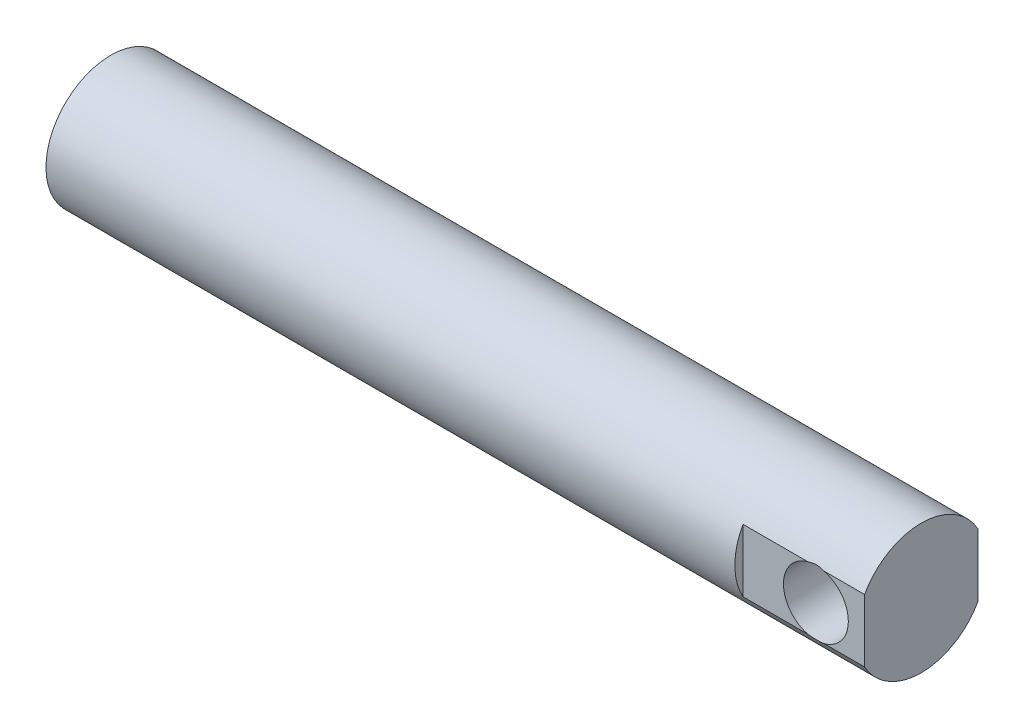
ISO-10303-21;
HEADER;
FILE_DESCRIPTION(('STEP AP214'),'2;1');
FILE_NAME('part.step','',(''),(''),'','','');
FILE_SCHEMA(('AUTOMOTIVE_DESIGN { 1 0 10303 214 1 1 1 1 }'));
ENDSEC;
DATA;
#1=APPLICATION_CONTEXT('core data for automotive mechanical design processes');
#2=APPLICATION_PROTOCOL_DEFINITION('international standard','automotive_design',2000,#1);
#3=PRODUCT_CONTEXT('',#1,'mechanical');
#4=PRODUCT('Part','Part','',(#3));
#5=PRODUCT_RELATED_PRODUCT_CATEGORY('part','',(#4));
#6=PRODUCT_DEFINITION_FORMATION('','',#4);
#7=PRODUCT_DEFINITION_CONTEXT('part definition',#1,'design');
#8=PRODUCT_DEFINITION('design','',#6,#7);
#9=PRODUCT_DEFINITION_SHAPE('','',#8);
#10=(LENGTH_UNIT() NAMED_UNIT(*) SI_UNIT(.MILLI.,.METRE.));
#11=(NAMED_UNIT(*) PLANE_ANGLE_UNIT() SI_UNIT($,.RADIAN.));
#12=(NAMED_UNIT(*) SI_UNIT($,.STERADIAN.) SOLID_ANGLE_UNIT());
#13=UNCERTAINTY_MEASURE_WITH_UNIT(LENGTH_MEASURE(1.E-05),#10,'distance_accuracy_value','');
#14=(GEOMETRIC_REPRESENTATION_CONTEXT(3) GLOBAL_UNCERTAINTY_ASSIGNED_CONTEXT((#13)) GLOBAL_UNIT_ASSIGNED_CONTEXT((#10,
#11,#12)) REPRESENTATION_CONTEXT('',''));
#15=CARTESIAN_POINT('',(0.,0.,0.));
#16=DIRECTION('',(0.,0.,1.));
#17=DIRECTION('',(1.,0.,0.));
#18=AXIS2_PLACEMENT_3D('',#15,#16,#17);
#19=CARTESIAN_POINT('',(111.125,12.2967221242086,22.225));
#20=DIRECTION('',(0.,0.,-1.));
#21=DIRECTION('',(-1.,0.,0.));
#22=AXIS2_PLACEMENT_3D('',#19,#20,#21);
#23=PLANE('',#22);
#24=DIRECTION('',(1.,0.,0.));
#25=VECTOR('',#24,1.);
#26=CARTESIAN_POINT('',(111.125,12.2967221242086,22.225));
#27=LINE('',#26,#25);
#28=CARTESIAN_POINT('',(142.875,12.2967221242086,22.225));
#29=VERTEX_POINT('',#28);
#30=CARTESIAN_POINT('',(158.75,12.2967221242086,22.225));
#31=VERTEX_POINT('',#30);
#32=EDGE_CURVE('E112',#29,#31,#27,.T.);
#33=ORIENTED_EDGE('',*,*,#32,.F.);
#34=CARTESIAN_POINT('',(139.7,0.,22.225));
#35=DIRECTION('',(0.,0.,1.));
#36=DIRECTION('',(1.,0.,0.));
#37=AXIS2_PLACEMENT_3D('',#34,#35,#36);
#38=CIRCLE('',#37,12.7);
#39=CARTESIAN_POINT('',(142.875,-12.2967221242086,22.225));
#40=VERTEX_POINT('',#39);
#41=EDGE_CURVE('E98',#40,#29,#38,.T.);
#42=ORIENTED_EDGE('',*,*,#41,.F.);
#43=DIRECTION('',(1.,0.,0.));
#44=VECTOR('',#43,1.);
#45=CARTESIAN_POINT('',(111.125,-12.2967221242086,22.225));
#46=LINE('',#45,#44);
#47=CARTESIAN_POINT('',(158.75,-12.2967221242086,22.225));
#48=VERTEX_POINT('',#47);
#49=EDGE_CURVE('E125',#40,#48,#46,.T.);
#50=ORIENTED_EDGE('',*,*,#49,.T.);
#51=DIRECTION('',(0.,1.,0.));
#52=VECTOR('',#51,1.);
#53=CARTESIAN_POINT('',(158.75,12.2967221242086,22.225));
#54=LINE('',#53,#52);
#55=EDGE_CURVE('E120',#48,#31,#54,.T.);
#56=ORIENTED_EDGE('',*,*,#55,.T.);
#57=EDGE_LOOP('',(#33,#42,#50,#56));
#58=FACE_BOUND('',#57,.T.);
#59=ADVANCED_FACE('F34',(#58),#23,.F.);
#60=CARTESIAN_POINT('',(111.125,12.2967221242086,-22.225));
#61=DIRECTION('',(0.,0.,1.));
#62=DIRECTION('',(0.,-1.,0.));
#63=AXIS2_PLACEMENT_3D('',#60,#61,#62);
#64=PLANE('',#63);
#65=DIRECTION('',(1.,0.,0.));
#66=VECTOR('',#65,1.);
#67=CARTESIAN_POINT('',(111.125,-12.2967221242086,-22.225));
#68=LINE('',#67,#66);
#69=CARTESIAN_POINT('',(142.875,-12.2967221242086,-22.225));
#70=VERTEX_POINT('',#69);
#71=CARTESIAN_POINT('',(158.75,-12.2967221242086,-22.225));
#72=VERTEX_POINT('',#71);
#73=EDGE_CURVE('E149',#70,#72,#68,.T.);
#74=ORIENTED_EDGE('',*,*,#73,.F.);
#75=CARTESIAN_POINT('',(139.7,0.,-22.225));
#76=DIRECTION('',(0.,0.,1.));
#77=DIRECTION('',(0.,-1.,0.));
#78=AXIS2_PLACEMENT_3D('',#75,#76,#77);
#79=CIRCLE('',#78,12.7);
#80=CARTESIAN_POINT('',(142.875,12.2967221242086,-22.225));
#81=VERTEX_POINT('',#80);
#82=EDGE_CURVE('E11',#70,#81,#79,.T.);
#83=ORIENTED_EDGE('',*,*,#82,.T.);
#84=DIRECTION('',(1.,0.,0.));
#85=VECTOR('',#84,1.);
#86=CARTESIAN_POINT('',(111.125,12.2967221242086,-22.225));
#87=LINE('',#86,#85);
#88=CARTESIAN_POINT('',(158.75,12.2967221242086,-22.225));
#89=VERTEX_POINT('',#88);
#90=EDGE_CURVE('E142',#81,#89,#87,.T.);
#91=ORIENTED_EDGE('',*,*,#90,.T.);
#92=DIRECTION('',(0.,-1.,0.));
#93=VECTOR('',#92,1.);
#94=CARTESIAN_POINT('',(158.75,12.2967221242086,-22.225));
#95=LINE('',#94,#93);
#96=EDGE_CURVE('E140',#89,#72,#95,.T.);
#97=ORIENTED_EDGE('',*,*,#96,.T.);
#98=EDGE_LOOP('',(#74,#83,#91,#97));
#99=FACE_BOUND('',#98,.T.);
#100=ADVANCED_FACE('F165',(#99),#64,.F.);
#101=CARTESIAN_POINT('',(158.75,0.,0.));
#102=DIRECTION('',(-1.,0.,0.));
#103=DIRECTION('',(0.,0.,1.));
#104=AXIS2_PLACEMENT_3D('',#101,#102,#103);
#105=CYLINDRICAL_SURFACE('',#104,25.4);
#106=ORIENTED_EDGE('',*,*,#90,.F.);
#107=CARTESIAN_POINT('',(152.4,0.,-25.4));
#108=CARTESIAN_POINT('',(152.399998896615,0.333981739515307,-25.3999989853182));
#109=CARTESIAN_POINT('',(152.386810397303,0.667986830049913,-25.3933973763064));
#110=CARTESIAN_POINT('',(152.334206602415,1.3335371235604,-25.3671572099796));
#111=CARTESIAN_POINT('',(152.294779897339,1.66508119293284,-25.3475129811819));
#112=CARTESIAN_POINT('',(152.190079273794,2.32363297076385,-25.2956520031994));
#113=CARTESIAN_POINT('',(152.124761935439,2.65063209868327,-25.2634141351734));
#114=CARTESIAN_POINT('',(151.969040468054,3.29715092159512,-25.187194157906));
#115=CARTESIAN_POINT('',(151.878638847968,3.61667136114571,-25.1432132232287));
#116=CARTESIAN_POINT('',(151.674107367242,4.24493482764714,-25.0447848397741));
#117=CARTESIAN_POINT('',(151.560071698331,4.55371512034307,-24.990379001715));
#118=CARTESIAN_POINT('',(151.309140711461,5.15999008748526,-24.8722716612453));
#119=CARTESIAN_POINT('',(151.172244901321,5.45748451877714,-24.808569958698));
#120=CARTESIAN_POINT('',(150.876801069654,6.03950276546307,-24.6733386890576));
#121=CARTESIAN_POINT('',(150.718261043729,6.32403131906073,-24.6018120145214));
#122=CARTESIAN_POINT('',(150.380589600246,6.87899412043412,-24.4524448779142));
#123=CARTESIAN_POINT('',(150.201450064508,7.14942275004727,-24.3746019302087));
#124=CARTESIAN_POINT('',(149.812369204499,7.69075365118995,-24.2094431690092));
#125=CARTESIAN_POINT('',(149.601222001656,7.9607015361148,-24.121839186622));
#126=CARTESIAN_POINT('',(149.158394684498,8.48208538603014,-23.9434784367624));
#127=CARTESIAN_POINT('',(148.926713396389,8.73352029125241,-23.8527214892368));
#128=CARTESIAN_POINT('',(148.443901005271,9.21688410775374,-23.6701465014508));
#129=CARTESIAN_POINT('',(148.19275786608,9.44880076003464,-23.5783278349162));
#130=CARTESIAN_POINT('',(147.672295518837,9.89188219167436,-23.3958989598871));
#131=CARTESIAN_POINT('',(147.402972910633,10.1030430707875,-23.3052889812731));
#132=CARTESIAN_POINT('',(146.825724628682,10.5190431108218,-23.1206719976141));
#133=CARTESIAN_POINT('',(146.516426068485,10.7221091906023,-23.0269500063869));
#134=CARTESIAN_POINT('',(145.879872710781,11.1011861167195,-22.8466129893767));
#135=CARTESIAN_POINT('',(145.55262560304,11.2772084285377,-22.7599949590983));
#136=CARTESIAN_POINT('',(144.881982012012,11.6006724786736,-22.5968409665416));
#137=CARTESIAN_POINT('',(144.538590456169,11.7481228679528,-22.52030195481));
#138=CARTESIAN_POINT('',(143.837804839178,12.012860434759,-22.3802066446356));
#139=CARTESIAN_POINT('',(143.480412334666,12.1301509545783,-22.3166489077791));
#140=CARTESIAN_POINT('',(142.776047898913,12.32694332646,-22.2085190947532));
#141=CARTESIAN_POINT('',(142.429730055661,12.40828490841,-22.1630392470512));
#142=CARTESIAN_POINT('',(141.729820089538,12.5417989074481,-22.0877609445474));
#143=CARTESIAN_POINT('',(141.376228278508,12.5939725722949,-22.0579618189517));
#144=CARTESIAN_POINT('',(140.665181456172,12.6683106717967,-22.0153526159295));
#145=CARTESIAN_POINT('',(140.307729971038,12.6905004893288,-22.0025281687483));
#146=CARTESIAN_POINT('',(139.592046823177,12.704582167794,-21.9944010073532));
#147=CARTESIAN_POINT('',(139.233815238145,12.6964769194155,-21.9990966214137));
#148=CARTESIAN_POINT('',(138.562769148624,12.6528993946576,-22.0241829687435));
#149=CARTESIAN_POINT('',(138.249653652757,12.6208210146195,-22.0426266092468));
#150=CARTESIAN_POINT('',(137.627686858614,12.5337187372848,-22.0922703530644));
#151=CARTESIAN_POINT('',(137.318835162987,12.4786969932331,-22.1234692592861));
#152=CARTESIAN_POINT('',(136.707329569927,12.3463285764693,-22.1976104371198));
#153=CARTESIAN_POINT('',(136.404677245583,12.2689763107443,-22.2405556506284));
#154=CARTESIAN_POINT('',(135.80740684521,12.0927532026457,-22.3368616715988));
#155=CARTESIAN_POINT('',(135.512789198082,11.9938812140458,-22.3902230338506));
#156=CARTESIAN_POINT('',(134.926441360247,11.7730004100222,-22.5071638101794));
#157=CARTESIAN_POINT('',(134.634933693557,11.6505114572299,-22.5709501339185));
#158=CARTESIAN_POINT('',(134.06319067177,11.3848929872549,-22.7060875571666));
#159=CARTESIAN_POINT('',(133.782959394253,11.2417560879774,-22.7774413597895));
#160=CARTESIAN_POINT('',(133.234989188452,10.9358182316735,-22.9258976573678));
#161=CARTESIAN_POINT('',(132.967252231187,10.7730141865328,-23.0030010543891));
#162=CARTESIAN_POINT('',(132.44531739979,10.4286789457167,-23.1611431305516));
#163=CARTESIAN_POINT('',(132.191120614201,10.247146247813,-23.2421821250914));
#164=CARTESIAN_POINT('',(131.665799184973,9.8420107121796,-23.4168626957935));
#165=CARTESIAN_POINT('',(131.396629774046,9.6159933444569,-23.5107968618277));
#166=CARTESIAN_POINT('',(130.87807956895,9.1425892225115,-23.6989010834753));
#167=CARTESIAN_POINT('',(130.62869192976,8.89520992251964,-23.793071045759));
#168=CARTESIAN_POINT('',(130.150683243836,8.37998417626854,-23.9793861747464));
#169=CARTESIAN_POINT('',(129.922080683257,8.11211989308367,-24.0715294848011));
#170=CARTESIAN_POINT('',(129.487353819729,7.55750968550681,-24.2513709753996));
#171=CARTESIAN_POINT('',(129.281220552813,7.27077136454423,-24.3390709210641));
#172=CARTESIAN_POINT('',(128.883669251477,6.6658841568592,-24.5118230016575));
#173=CARTESIAN_POINT('',(128.693391525684,6.34689326064717,-24.5965590858203));
#174=CARTESIAN_POINT('',(128.340651069073,5.69154307245135,-24.7564149953084));
#175=CARTESIAN_POINT('',(128.178189633555,5.35518297259775,-24.8315343727788));
#176=CARTESIAN_POINT('',(127.882911235131,4.66758048922762,-24.9699135244723));
#177=CARTESIAN_POINT('',(127.750075423712,4.3163477382848,-25.0331808351319));
#178=CARTESIAN_POINT('',(127.515555510695,3.6014947592694,-25.1459758955137));
#179=CARTESIAN_POINT('',(127.413867825475,3.23787596157583,-25.1955052257411));
#180=CARTESIAN_POINT('',(127.250106356294,2.53187304245653,-25.2757829724694));
#181=CARTESIAN_POINT('',(127.185448901197,2.19022496284147,-25.3077472525625));
#182=CARTESIAN_POINT('',(127.084308749468,1.50178254887062,-25.3579125234381));
#183=CARTESIAN_POINT('',(127.047824520333,1.15498849547995,-25.376114262843));
#184=CARTESIAN_POINT('',(127.003522571661,0.459259245396033,-25.3982316637035));
#185=CARTESIAN_POINT('',(126.995693390491,0.11032496072042,-25.4021530371102));
#186=CARTESIAN_POINT('',(127.008777211823,-0.586861016664052,-25.3956118092802));
#187=CARTESIAN_POINT('',(127.029688942313,-0.93511273889858,-25.3851498446196));
#188=CARTESIAN_POINT('',(127.097233806195,-1.60108362973275,-25.3515077595982));
#189=CARTESIAN_POINT('',(127.14174411373,-1.91907428933857,-25.3293780228497));
#190=CARTESIAN_POINT('',(127.254469937626,-2.54978330914382,-25.273678325219));
#191=CARTESIAN_POINT('',(127.322683928739,-2.86250200721795,-25.2401091004297));
#192=CARTESIAN_POINT('',(127.482109607123,-3.48066904504634,-25.1623132722535));
#193=CARTESIAN_POINT('',(127.573322573428,-3.78611697941983,-25.1180860761546));
#194=CARTESIAN_POINT('',(127.777868823779,-4.38791536619636,-25.0199752666444));
#195=CARTESIAN_POINT('',(127.891203037251,-4.68426543574603,-24.9660912475084));
#196=CARTESIAN_POINT('',(128.142543331539,-5.27456345379851,-24.8481817977321));
#197=CARTESIAN_POINT('',(128.281161054888,-5.56820164841312,-24.7839108906406));
#198=CARTESIAN_POINT('',(128.579624581437,-6.14264016029434,-24.6478216718728));
#199=CARTESIAN_POINT('',(128.739470571154,-6.42344036473425,-24.5760032938838));
#200=CARTESIAN_POINT('',(129.079283659053,-6.97095514352866,-24.4263453130256));
#201=CARTESIAN_POINT('',(129.259253969339,-7.2376674592415,-24.3485047495499));
#202=CARTESIAN_POINT('',(129.638257049122,-7.75592936029114,-24.1884095985597));
#203=CARTESIAN_POINT('',(129.837297229969,-8.00747298805149,-24.1061533004114));
#204=CARTESIAN_POINT('',(130.273745462242,-8.51817711087695,-23.9307442269765));
#205=CARTESIAN_POINT('',(130.513001932902,-8.77566505871023,-23.8373139847612));
#206=CARTESIAN_POINT('',(131.011832222224,-9.26978993748336,-23.6495426598325));
#207=CARTESIAN_POINT('',(131.271406942926,-9.50642594169611,-23.5552015368431));
#208=CARTESIAN_POINT('',(131.809748915383,-9.9577803333217,-23.3679768946093));
#209=CARTESIAN_POINT('',(132.088527688393,-10.1724853683333,-23.2750942921448));
#210=CARTESIAN_POINT('',(132.663879219626,-10.5786113886088,-23.0933430698519));
#211=CARTESIAN_POINT('',(132.960455023508,-10.7700283714515,-23.0044751416544));
#212=CARTESIAN_POINT('',(133.584851736283,-11.1369832344928,-22.8291690251634));
#213=CARTESIAN_POINT('',(133.913491118688,-11.3112905186057,-22.7430609929264));
#214=CARTESIAN_POINT('',(134.586744198267,-11.6311402572403,-22.5811584719303));
#215=CARTESIAN_POINT('',(134.931350014701,-11.7766967197936,-22.5053589662662));
#216=CARTESIAN_POINT('',(135.634157948892,-12.037411505745,-22.3669961021959));
#217=CARTESIAN_POINT('',(135.99234892186,-12.1525941551279,-22.3044221596331));
#218=CARTESIAN_POINT('',(136.719796784281,-12.3511321934017,-22.1950991305999));
#219=CARTESIAN_POINT('',(137.089051950792,-12.4344925102491,-22.1483475940237));
#220=CARTESIAN_POINT('',(137.799476468574,-12.5616660551725,-22.0764431304296));
#221=CARTESIAN_POINT('',(138.13993930223,-12.608507390252,-22.0496476874357));
#222=CARTESIAN_POINT('',(138.824412043515,-12.6744436961492,-22.0118137542883));
#223=CARTESIAN_POINT('',(139.168421708312,-12.6935405539445,-22.0007741925353));
#224=CARTESIAN_POINT('',(139.856862230943,-12.703695277592,-21.9949120973631));
#225=CARTESIAN_POINT('',(140.201292885865,-12.6947635143065,-22.0000835657043));
#226=CARTESIAN_POINT('',(140.887668579429,-12.6490209144205,-22.0264151695763));
#227=CARTESIAN_POINT('',(141.229613719249,-12.6122112191299,-22.047574650565));
#228=CARTESIAN_POINT('',(141.8756553578,-12.5161004787777,-22.1022610371251));
#229=CARTESIAN_POINT('',(142.180243997861,-12.459287127056,-22.1344116195814));
#230=CARTESIAN_POINT('',(142.783216097373,-12.3239312228111,-22.2100591546771));
#231=CARTESIAN_POINT('',(143.081597468926,-12.2453814820754,-22.2535598605241));
#232=CARTESIAN_POINT('',(143.670355686403,-12.0673473817123,-22.3506015510282));
#233=CARTESIAN_POINT('',(143.960732436999,-11.9678627728893,-22.4041426551992));
#234=CARTESIAN_POINT('',(144.532065788238,-11.7488195507075,-22.519781701125));
#235=CARTESIAN_POINT('',(144.813021458716,-11.6292589621583,-22.5818804847256));
#236=CARTESIAN_POINT('',(145.382783535111,-11.3622832222954,-22.7174471190576));
#237=CARTESIAN_POINT('',(145.670851098984,-11.2135370840752,-22.7913983059316));
#238=CARTESIAN_POINT('',(146.233588913058,-10.8952616165814,-22.9452502378199));
#239=CARTESIAN_POINT('',(146.508258754693,-10.7257316540541,-23.0251511640853));
#240=CARTESIAN_POINT('',(147.043204345716,-10.3668284593029,-23.1889582384036));
#241=CARTESIAN_POINT('',(147.303474621084,-10.1774477589083,-23.2728658873407));
#242=CARTESIAN_POINT('',(147.808527477723,-9.77983136556839,-23.4427311863481));
#243=CARTESIAN_POINT('',(148.053307730105,-9.57159284878115,-23.528689142015));
#244=CARTESIAN_POINT('',(148.555191928382,-9.11072677563029,-23.711248812632));
#245=CARTESIAN_POINT('',(148.810165853706,-8.85578185877035,-23.8078718018046));
#246=CARTESIAN_POINT('',(149.297842973419,-8.32474216508725,-23.9987134587596));
#247=CARTESIAN_POINT('',(149.530553084522,-8.04865400515574,-24.0929328665496));
#248=CARTESIAN_POINT('',(149.972494337237,-7.47640587939175,-24.2766083304988));
#249=CARTESIAN_POINT('',(150.181706791451,-7.18023023426302,-24.3660605660898));
#250=CARTESIAN_POINT('',(150.574856495189,-6.56957720386057,-24.5377510994302));
#251=CARTESIAN_POINT('',(150.758795201072,-6.25510087462242,-24.6199898127485));
#252=CARTESIAN_POINT('',(151.101006274097,-5.60733244659949,-24.775583683568));
#253=CARTESIAN_POINT('',(151.259085600324,-5.27392182955082,-24.8488710756026));
#254=CARTESIAN_POINT('',(151.546331771874,-4.59250800244654,-24.9837845064944));
#255=CARTESIAN_POINT('',(151.675494474852,-4.2445027101505,-25.0454088744118));
#256=CARTESIAN_POINT('',(151.903033127907,-3.53745101854024,-25.1550014525238));
#257=CARTESIAN_POINT('',(152.001485798656,-3.17843463507943,-25.2030036664245));
#258=CARTESIAN_POINT('',(152.16667063136,-2.45170099217833,-25.2840399484603));
#259=CARTESIAN_POINT('',(152.233422169876,-2.0839891922813,-25.3170831593495));
#260=CARTESIAN_POINT('',(152.322465107999,-1.43012607451319,-25.3613001361843));
#261=CARTESIAN_POINT('',(152.351515802365,-1.14509763364969,-25.3757872070441));
#262=CARTESIAN_POINT('',(152.390283988769,-0.573385228030413,-25.3951377072838));
#263=CARTESIAN_POINT('',(152.400000947183,-0.28670121779879,-25.4000008710371));
#264=CARTESIAN_POINT('',(152.4,0.,-25.4));
#265=B_SPLINE_CURVE_WITH_KNOTS('',3,(#107,#108,#109,#110,#111,#112,#113,#114,#115,#116,#117,
#118,#119,#120,#121,#122,#123,#124,#125,#126,#127,#128,#129,#130,#131,#132,#133,#134,#135,#136,
#137,#138,#139,#140,#141,#142,#143,#144,#145,#146,#147,#148,#149,#150,#151,#152,#153,#154,#155,
#156,#157,#158,#159,#160,#161,#162,#163,#164,#165,#166,#167,#168,#169,#170,#171,#172,#173,#174,
#175,#176,#177,#178,#179,#180,#181,#182,#183,#184,#185,#186,#187,#188,#189,#190,#191,#192,#193,
#194,#195,#196,#197,#198,#199,#200,#201,#202,#203,#204,#205,#206,#207,#208,#209,#210,#211,#212,
#213,#214,#215,#216,#217,#218,#219,#220,#221,#222,#223,#224,#225,#226,#227,#228,#229,#230,#231,
#232,#233,#234,#235,#236,#237,#238,#239,#240,#241,#242,#243,#244,#245,#246,#247,#248,#249,#250,
#251,#252,#253,#254,#255,#256,#257,#258,#259,#260,#261,#262,#263,#264),.UNSPECIFIED.,.T.,.F.,(4,
2,2,2,2,2,2,2,2,2,2,2,2,2,2,2,2,2,2,2,2,2,2,2,2,2,2,2,2,2,2,2,2,2,2,2,2,2,2,2,2,2,2,2,2,2,2,2,2,
2,2,2,2,2,2,2,2,2,2,2,2,2,2,2,2,2,2,2,2,2,2,2,2,2,2,2,2,2,4),(0.,1.00166244834877,
2.00376074741019,3.00754677431463,4.0112324382057,5.01099236691032,6.01077382326806,
7.01018694412445,8.00999528810309,9.07008101150199,10.1302273719864,11.1910346944141,
12.2520409750345,13.3956782307905,14.5388292838999,15.681633672854,16.8243113625255,
17.898685626109,18.9730139260909,20.0464321806329,21.119748014588,22.0645172495435,
23.0091978374434,23.9541152403088,24.8990829855618,25.8657999172385,26.8328633320399,
27.8000787919632,28.7673718927978,29.857615337213,30.9474798675338,32.0383044257346,
33.1286922020028,34.2701150769874,35.4115910893017,36.5523387830103,37.6929551833131,
38.7390887427803,39.7851653930304,40.8308235809383,41.8764354917158,42.8408747254882,
43.8052519125268,44.769682742979,45.7341541028154,46.7261420305847,47.7181386747664,
48.7102938811224,49.7028362568089,50.7927233532177,51.8826588632918,52.9732540606308,
54.0640364300638,55.2080441760109,56.3514931538855,57.4940235580266,58.6363769598511,
59.6690724335716,60.7016976675711,61.7339408652467,62.7661418056353,63.699625773907,
64.6334188145207,65.567222971057,66.5011190545062,67.4976998563333,68.4943110301204,
69.4912985002233,70.4884355107078,71.60701690862,72.7252496598997,73.844365523257,
74.9634168722763,76.0904743099989,77.2176930971081,78.3420728530677,79.4657644714287,
80.3256016535503,81.1854625674484),.UNSPECIFIED.);
#266=CARTESIAN_POINT('',(136.525,12.2967221242086,-22.225));
#267=VERTEX_POINT('',#266);
#268=EDGE_CURVE('E116',#81,#267,#265,.T.);
#269=ORIENTED_EDGE('',*,*,#268,.T.);
#270=CARTESIAN_POINT('',(111.125,12.2967221242086,-22.225));
#271=VERTEX_POINT('',#270);
#272=EDGE_CURVE('E146',#271,#267,#87,.T.);
#273=ORIENTED_EDGE('',*,*,#272,.F.);
#274=CARTESIAN_POINT('',(111.125,0.,0.));
#275=DIRECTION('',(1.,0.,0.));
#276=DIRECTION('',(0.,0.,-1.));
#277=AXIS2_PLACEMENT_3D('',#274,#275,#276);
#278=CIRCLE('',#277,25.4);
#279=CARTESIAN_POINT('',(111.125,-12.2967221242086,-22.225));
#280=VERTEX_POINT('',#279);
#281=EDGE_CURVE('E151',#280,#271,#278,.T.);
#282=ORIENTED_EDGE('',*,*,#281,.F.);
#283=CARTESIAN_POINT('',(136.525,-12.2967221242086,-22.225));
#284=VERTEX_POINT('',#283);
#285=EDGE_CURVE('E155',#280,#284,#68,.T.);
#286=ORIENTED_EDGE('',*,*,#285,.T.);
#287=EDGE_CURVE('E58',#284,#70,#265,.T.);
#288=ORIENTED_EDGE('',*,*,#287,.T.);
#289=ORIENTED_EDGE('',*,*,#73,.T.);
#290=CARTESIAN_POINT('',(158.75,0.,0.));
#291=DIRECTION('',(1.,0.,0.));
#292=DIRECTION('',(0.,0.,-1.));
#293=AXIS2_PLACEMENT_3D('',#290,#291,#292);
#294=CIRCLE('',#293,25.4);
#295=EDGE_CURVE('E130',#48,#72,#294,.T.);
#296=ORIENTED_EDGE('',*,*,#295,.F.);
#297=ORIENTED_EDGE('',*,*,#49,.F.);
#298=CARTESIAN_POINT('',(142.875,-12.2967221242086,22.225));
#299=CARTESIAN_POINT('',(142.721963097166,-12.3362361268532,22.2031359236432));
#300=CARTESIAN_POINT('',(142.568014318775,-12.3729374263929,22.1826939822421));
#301=CARTESIAN_POINT('',(142.258491550786,-12.4406280983119,22.1448027433432));
#302=CARTESIAN_POINT('',(142.102917459438,-12.4716171107869,22.1273536344143));
#303=CARTESIAN_POINT('',(141.634042413095,-12.5558864817773,22.0797177795475));
#304=CARTESIAN_POINT('',(141.318629694181,-12.6004585665648,22.0542484285288));
#305=CARTESIAN_POINT('',(140.692202687896,-12.6650042319372,22.0172433884754));
#306=CARTESIAN_POINT('',(140.381264366951,-12.6855421915452,22.0053881382308));
#307=CARTESIAN_POINT('',(139.758575841223,-12.703680650376,21.9949228091537));
#308=CARTESIAN_POINT('',(139.446825993064,-12.701289933003,21.9963076583686));
#309=CARTESIAN_POINT('',(138.916697492141,-12.6777199853746,22.0098954763644));
#310=CARTESIAN_POINT('',(138.697951777795,-12.6623019748434,22.0187805026914));
#311=CARTESIAN_POINT('',(138.261900414436,-12.6202152787368,22.0429298740709));
#312=CARTESIAN_POINT('',(138.044594689887,-12.5935471881204,22.0581938817713));
#313=CARTESIAN_POINT('',(137.608422749893,-12.5285573345811,22.0951736648227));
#314=CARTESIAN_POINT('',(137.389594592778,-12.4900419132978,22.1169965046795));
#315=CARTESIAN_POINT('',(136.954899028581,-12.4017610599263,22.1666138354489));
#316=CARTESIAN_POINT('',(136.73903166619,-12.3519954582238,22.1944084163946));
#317=CARTESIAN_POINT('',(136.525,-12.2967221242086,22.225));
#318=B_SPLINE_CURVE_WITH_KNOTS('',3,(#298,#299,#300,#301,#302,#303,#304,#305,#306,#307,#308,
#309,#310,#311,#312,#313,#314,#315,#316,#317),.UNSPECIFIED.,.F.,.F.,(4,2,2,2,2,2,2,2,2,4),(0.,
0.478613258258702,0.957256661372284,1.91467137076094,2.84912140823021,3.78321349549884,
4.44126028012997,5.09927226839961,5.76866978473143,6.43807739396436),.UNSPECIFIED.);
#319=CARTESIAN_POINT('',(136.525,-12.2967221242086,22.225));
#320=VERTEX_POINT('',#319);
#321=EDGE_CURVE('E101',#40,#320,#318,.T.);
#322=ORIENTED_EDGE('',*,*,#321,.T.);
#323=CARTESIAN_POINT('',(111.125,-12.2967221242086,22.225));
#324=VERTEX_POINT('',#323);
#325=EDGE_CURVE('E121',#324,#320,#46,.T.);
#326=ORIENTED_EDGE('',*,*,#325,.F.);
#327=CARTESIAN_POINT('',(111.125,0.,0.));
#328=DIRECTION('',(1.,0.,0.));
#329=DIRECTION('',(0.,0.,-1.));
#330=AXIS2_PLACEMENT_3D('',#327,#328,#329);
#331=CIRCLE('',#330,25.4);
#332=CARTESIAN_POINT('',(111.125,12.2967221242086,22.225));
#333=VERTEX_POINT('',#332);
#334=EDGE_CURVE('E157',#333,#324,#331,.T.);
#335=ORIENTED_EDGE('',*,*,#334,.F.);
#336=CARTESIAN_POINT('',(136.525,12.2967221242086,22.225));
#337=VERTEX_POINT('',#336);
#338=EDGE_CURVE('E115',#333,#337,#27,.T.);
#339=ORIENTED_EDGE('',*,*,#338,.T.);
#340=CARTESIAN_POINT('',(136.525,12.2967221242086,22.225));
#341=CARTESIAN_POINT('',(136.678036902834,12.3362361268532,22.2031359236432));
#342=CARTESIAN_POINT('',(136.831985681225,12.3729374263929,22.1826939822421));
#343=CARTESIAN_POINT('',(137.141508449214,12.4406280983119,22.1448027433432));
#344=CARTESIAN_POINT('',(137.297082540562,12.4716171107869,22.1273536344144));
#345=CARTESIAN_POINT('',(137.765957586905,12.5558864817773,22.0797177795475));
#346=CARTESIAN_POINT('',(138.081370305819,12.6004585665648,22.0542484285289));
#347=CARTESIAN_POINT('',(138.707797312104,12.6650042319372,22.0172433884754));
#348=CARTESIAN_POINT('',(139.018735633049,12.6855421915452,22.0053881382308));
#349=CARTESIAN_POINT('',(139.641424158777,12.703680650376,21.9949228091537));
#350=CARTESIAN_POINT('',(139.953174006936,12.701289933003,21.9963076583686));
#351=CARTESIAN_POINT('',(140.483302507859,12.6777199853746,22.0098954763644));
#352=CARTESIAN_POINT('',(140.702048222205,12.6623019748434,22.0187805026914));
#353=CARTESIAN_POINT('',(141.138099585564,12.6202152787368,22.0429298740709));
#354=CARTESIAN_POINT('',(141.355405310113,12.5935471881204,22.0581938817713));
#355=CARTESIAN_POINT('',(141.791577250107,12.5285573345811,22.0951736648227));
#356=CARTESIAN_POINT('',(142.010405407222,12.4900419132978,22.1169965046795));
#357=CARTESIAN_POINT('',(142.445100971419,12.4017610599263,22.1666138354489));
#358=CARTESIAN_POINT('',(142.66096833381,12.3519954582238,22.1944084163946));
#359=CARTESIAN_POINT('',(142.875,12.2967221242086,22.225));
#360=B_SPLINE_CURVE_WITH_KNOTS('',3,(#340,#341,#342,#343,#344,#345,#346,#347,#348,#349,#350,
#351,#352,#353,#354,#355,#356,#357,#358,#359),.UNSPECIFIED.,.F.,.F.,(4,2,2,2,2,2,2,2,2,4),(0.,
0.4786132582587,0.957256661372283,1.91467137076093,2.84912140823021,3.78321349549884,
4.44126028012994,5.09927226839955,5.76866978473143,6.43807739396436),.UNSPECIFIED.);
#361=EDGE_CURVE('E50',#337,#29,#360,.T.);
#362=ORIENTED_EDGE('',*,*,#361,.T.);
#363=ORIENTED_EDGE('',*,*,#32,.T.);
#364=EDGE_CURVE('E132',#89,#31,#294,.T.);
#365=ORIENTED_EDGE('',*,*,#364,.F.);
#366=EDGE_LOOP('',(#106,#269,#273,#282,#286,#288,#289,#296,#297,#322,#326,#335,#339,#362,#363,#365));
#367=FACE_BOUND('',#366,.T.);
#368=CARTESIAN_POINT('',(-158.75,0.,0.));
#369=DIRECTION('',(1.,0.,0.));
#370=DIRECTION('',(0.,0.,-1.));
#371=AXIS2_PLACEMENT_3D('',#368,#369,#370);
#372=CIRCLE('',#371,25.4);
#373=CARTESIAN_POINT('',(-158.75,0.,-25.4));
#374=VERTEX_POINT('',#373);
#375=EDGE_CURVE('E123',#374,#374,#372,.T.);
#376=ORIENTED_EDGE('',*,*,#375,.T.);
#377=EDGE_LOOP('',(#376));
#378=FACE_BOUND('',#377,.T.);
#379=ADVANCED_FACE('F36',(#367,#378),#105,.T.);
#380=CARTESIAN_POINT('',(158.75,0.,0.));
#381=DIRECTION('',(1.,0.,0.));
#382=DIRECTION('',(0.,0.,-1.));
#383=AXIS2_PLACEMENT_3D('',#380,#381,#382);
#384=PLANE('',#383);
#385=ORIENTED_EDGE('',*,*,#96,.F.);
#386=ORIENTED_EDGE('',*,*,#364,.T.);
#387=ORIENTED_EDGE('',*,*,#55,.F.);
#388=ORIENTED_EDGE('',*,*,#295,.T.);
#389=EDGE_LOOP('',(#385,#386,#387,#388));
#390=FACE_BOUND('',#389,.T.);
#391=ADVANCED_FACE('F137',(#390),#384,.T.);
#392=CARTESIAN_POINT('',(-158.75,0.,0.));
#393=DIRECTION('',(1.,0.,0.));
#394=DIRECTION('',(0.,0.,-1.));
#395=AXIS2_PLACEMENT_3D('',#392,#393,#394);
#396=PLANE('',#395);
#397=ORIENTED_EDGE('',*,*,#375,.F.);
#398=EDGE_LOOP('',(#397));
#399=FACE_BOUND('',#398,.T.);
#400=ADVANCED_FACE('F196',(#399),#396,.F.);
#401=ORIENTED_EDGE('',*,*,#325,.T.);
#402=EDGE_CURVE('E105',#337,#320,#38,.T.);
#403=ORIENTED_EDGE('',*,*,#402,.F.);
#404=ORIENTED_EDGE('',*,*,#338,.F.);
#405=DIRECTION('',(0.,1.,0.));
#406=VECTOR('',#405,1.);
#407=CARTESIAN_POINT('',(111.125,12.2967221242086,22.225));
#408=LINE('',#407,#406);
#409=EDGE_CURVE('E158',#324,#333,#408,.T.);
#410=ORIENTED_EDGE('',*,*,#409,.F.);
#411=EDGE_LOOP('',(#401,#403,#404,#410));
#412=FACE_BOUND('',#411,.T.);
#413=ADVANCED_FACE('F186',(#412),#23,.F.);
#414=CARTESIAN_POINT('',(111.125,0.,0.));
#415=DIRECTION('',(1.,0.,0.));
#416=DIRECTION('',(0.,0.,-1.));
#417=AXIS2_PLACEMENT_3D('',#414,#415,#416);
#418=PLANE('',#417);
#419=ORIENTED_EDGE('',*,*,#334,.T.);
#420=ORIENTED_EDGE('',*,*,#409,.T.);
#421=EDGE_LOOP('',(#419,#420));
#422=FACE_BOUND('',#421,.T.);
#423=ADVANCED_FACE('F187',(#422),#418,.T.);
#424=ORIENTED_EDGE('',*,*,#272,.T.);
#425=EDGE_CURVE('E39',#267,#284,#79,.T.);
#426=ORIENTED_EDGE('',*,*,#425,.T.);
#427=ORIENTED_EDGE('',*,*,#285,.F.);
#428=DIRECTION('',(0.,-1.,0.));
#429=VECTOR('',#428,1.);
#430=CARTESIAN_POINT('',(111.125,12.2967221242086,-22.225));
#431=LINE('',#430,#429);
#432=EDGE_CURVE('E147',#271,#280,#431,.T.);
#433=ORIENTED_EDGE('',*,*,#432,.F.);
#434=EDGE_LOOP('',(#424,#426,#427,#433));
#435=FACE_BOUND('',#434,.T.);
#436=ADVANCED_FACE('F189',(#435),#64,.F.);
#437=CARTESIAN_POINT('',(111.125,0.,0.));
#438=DIRECTION('',(1.,0.,0.));
#439=DIRECTION('',(0.,0.,-1.));
#440=AXIS2_PLACEMENT_3D('',#437,#438,#439);
#441=PLANE('',#440);
#442=ORIENTED_EDGE('',*,*,#281,.T.);
#443=ORIENTED_EDGE('',*,*,#432,.T.);
#444=EDGE_LOOP('',(#442,#443));
#445=FACE_BOUND('',#444,.T.);
#446=ADVANCED_FACE('F179',(#445),#441,.T.);
#447=CARTESIAN_POINT('',(139.7,0.,-25.4));
#448=DIRECTION('',(0.,0.,1.));
#449=DIRECTION('',(1.,0.,0.));
#450=AXIS2_PLACEMENT_3D('',#447,#448,#449);
#451=CYLINDRICAL_SURFACE('',#450,12.7);
#452=ORIENTED_EDGE('',*,*,#287,.F.);
#453=ORIENTED_EDGE('',*,*,#425,.F.);
#454=ORIENTED_EDGE('',*,*,#268,.F.);
#455=ORIENTED_EDGE('',*,*,#82,.F.);
#456=EDGE_LOOP('',(#452,#453,#454,#455));
#457=FACE_BOUND('',#456,.T.);
#458=ORIENTED_EDGE('',*,*,#41,.T.);
#459=ORIENTED_EDGE('',*,*,#361,.F.);
#460=ORIENTED_EDGE('',*,*,#402,.T.);
#461=ORIENTED_EDGE('',*,*,#321,.F.);
#462=EDGE_LOOP('',(#458,#459,#460,#461));
#463=FACE_BOUND('',#462,.T.);
#464=ADVANCED_FACE('F99',(#457,#463),#451,.F.);
#465=CLOSED_SHELL('',(#59,#100,#379,#391,#400,#413,#423,#436,#446,#464));
#466=MANIFOLD_SOLID_BREP('B2',#465);
#467=ADVANCED_BREP_SHAPE_REPRESENTATION('',(#18,#466),#14);
#468=SHAPE_DEFINITION_REPRESENTATION(#9,#467);
ENDSEC;
END-ISO-10303-21;
